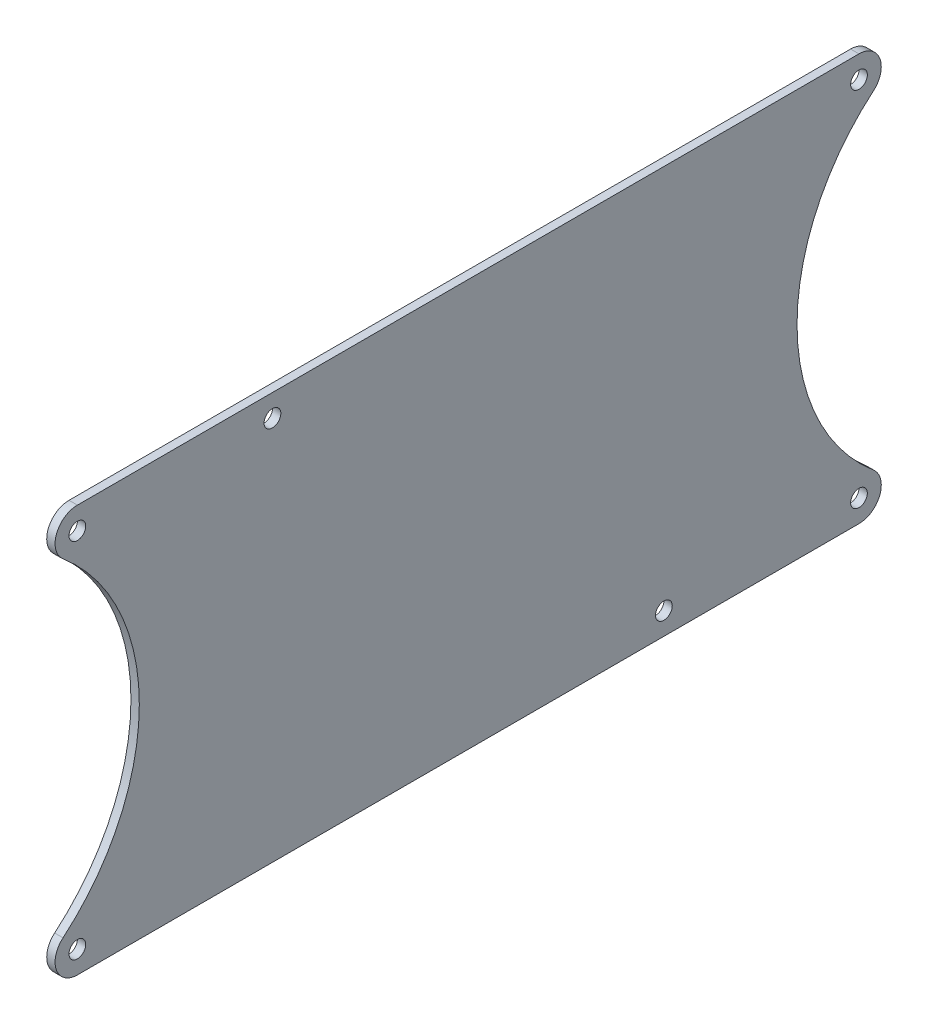
ISO-10303-21;
HEADER;
FILE_DESCRIPTION(('STEP AP214'),'2;1');
FILE_NAME('part.step','',(''),(''),'','','');
FILE_SCHEMA(('AUTOMOTIVE_DESIGN { 1 0 10303 214 1 1 1 1 }'));
ENDSEC;
DATA;
#1=APPLICATION_CONTEXT('core data for automotive mechanical design processes');
#2=APPLICATION_PROTOCOL_DEFINITION('international standard','automotive_design',2000,#1);
#3=PRODUCT_CONTEXT('',#1,'mechanical');
#4=PRODUCT('Part','Part','',(#3));
#5=PRODUCT_RELATED_PRODUCT_CATEGORY('part','',(#4));
#6=PRODUCT_DEFINITION_FORMATION('','',#4);
#7=PRODUCT_DEFINITION_CONTEXT('part definition',#1,'design');
#8=PRODUCT_DEFINITION('design','',#6,#7);
#9=PRODUCT_DEFINITION_SHAPE('','',#8);
#10=(LENGTH_UNIT() NAMED_UNIT(*) SI_UNIT(.MILLI.,.METRE.));
#11=(NAMED_UNIT(*) PLANE_ANGLE_UNIT() SI_UNIT($,.RADIAN.));
#12=(NAMED_UNIT(*) SI_UNIT($,.STERADIAN.) SOLID_ANGLE_UNIT());
#13=UNCERTAINTY_MEASURE_WITH_UNIT(LENGTH_MEASURE(1.E-05),#10,'distance_accuracy_value','');
#14=(GEOMETRIC_REPRESENTATION_CONTEXT(3) GLOBAL_UNCERTAINTY_ASSIGNED_CONTEXT((#13)) GLOBAL_UNIT_ASSIGNED_CONTEXT((#10,
#11,#12)) REPRESENTATION_CONTEXT('',''));
#15=CARTESIAN_POINT('',(0.,0.,0.));
#16=DIRECTION('',(0.,0.,1.));
#17=DIRECTION('',(1.,0.,0.));
#18=AXIS2_PLACEMENT_3D('',#15,#16,#17);
#19=CARTESIAN_POINT('',(1.5,3.71572232694461,-176.359202999625));
#20=DIRECTION('',(-1.,0.,0.));
#21=DIRECTION('',(0.,0.,1.));
#22=AXIS2_PLACEMENT_3D('',#19,#20,#21);
#23=CYLINDRICAL_SURFACE('',#22,38.5);
#24=CARTESIAN_POINT('',(0.,3.71572232694461,-176.359202999625));
#25=DIRECTION('',(1.,0.,0.));
#26=DIRECTION('',(0.,0.,-1.));
#27=AXIS2_PLACEMENT_3D('',#24,#25,#26);
#28=CIRCLE('',#27,38.5);
#29=CARTESIAN_POINT('',(0.,33.1568987975329,-151.550593042038));
#30=VERTEX_POINT('',#29);
#31=CARTESIAN_POINT('',(0.,-25.7254541436436,-151.550593042038));
#32=VERTEX_POINT('',#31);
#33=EDGE_CURVE('E120',#30,#32,#28,.T.);
#34=ORIENTED_EDGE('',*,*,#33,.F.);
#35=DIRECTION('',(-1.,0.,0.));
#36=VECTOR('',#35,1.);
#37=CARTESIAN_POINT('',(1.5,33.1568987975328,-151.550593042038));
#38=LINE('',#37,#36);
#39=CARTESIAN_POINT('',(1.5,33.1568987975329,-151.550593042038));
#40=VERTEX_POINT('',#39);
#41=EDGE_CURVE('E141',#30,#40,#38,.F.);
#42=ORIENTED_EDGE('',*,*,#41,.T.);
#43=CARTESIAN_POINT('',(1.5,3.71572232694461,-176.359202999625));
#44=DIRECTION('',(1.,0.,0.));
#45=DIRECTION('',(0.,0.,-1.));
#46=AXIS2_PLACEMENT_3D('',#43,#44,#45);
#47=CIRCLE('',#46,38.5);
#48=CARTESIAN_POINT('',(1.5,-25.7254541436436,-151.550593042038));
#49=VERTEX_POINT('',#48);
#50=EDGE_CURVE('E158',#40,#49,#47,.T.);
#51=ORIENTED_EDGE('',*,*,#50,.T.);
#52=DIRECTION('',(-1.,0.,0.));
#53=VECTOR('',#52,1.);
#54=CARTESIAN_POINT('',(1.5,-25.7254541436436,-151.550593042038));
#55=LINE('',#54,#53);
#56=EDGE_CURVE('E138',#49,#32,#55,.T.);
#57=ORIENTED_EDGE('',*,*,#56,.T.);
#58=EDGE_LOOP('',(#34,#42,#51,#57));
#59=FACE_BOUND('',#58,.T.);
#60=ADVANCED_FACE('F34',(#59),#23,.F.);
#61=CARTESIAN_POINT('',(1.5,40.2157223269446,0.));
#62=DIRECTION('',(0.,1.,0.));
#63=DIRECTION('',(0.,0.,1.));
#64=AXIS2_PLACEMENT_3D('',#61,#62,#63);
#65=PLANE('',#64);
#66=DIRECTION('',(0.,0.,-1.));
#67=VECTOR('',#66,1.);
#68=CARTESIAN_POINT('',(1.5,40.2157223269446,0.));
#69=LINE('',#68,#67);
#70=CARTESIAN_POINT('',(1.5,40.2157223269446,-8.74533087488335));
#71=VERTEX_POINT('',#70);
#72=CARTESIAN_POINT('',(1.5,40.2157223269446,-148.973075124367));
#73=VERTEX_POINT('',#72);
#74=EDGE_CURVE('E156',#71,#73,#69,.T.);
#75=ORIENTED_EDGE('',*,*,#74,.T.);
#76=DIRECTION('',(-1.,0.,0.));
#77=VECTOR('',#76,1.);
#78=CARTESIAN_POINT('',(1.5,40.2157223269446,-148.973075124367));
#79=LINE('',#78,#77);
#80=CARTESIAN_POINT('',(0.,40.2157223269446,-148.973075124367));
#81=VERTEX_POINT('',#80);
#82=EDGE_CURVE('E111',#73,#81,#79,.T.);
#83=ORIENTED_EDGE('',*,*,#82,.T.);
#84=DIRECTION('',(0.,0.,-1.));
#85=VECTOR('',#84,1.);
#86=CARTESIAN_POINT('',(0.,40.2157223269446,0.));
#87=LINE('',#86,#85);
#88=CARTESIAN_POINT('',(0.,40.2157223269446,-8.74533087488335));
#89=VERTEX_POINT('',#88);
#90=EDGE_CURVE('E103',#89,#81,#87,.T.);
#91=ORIENTED_EDGE('',*,*,#90,.F.);
#92=DIRECTION('',(-1.,0.,0.));
#93=VECTOR('',#92,1.);
#94=CARTESIAN_POINT('',(1.5,40.2157223269446,-8.74533087488335));
#95=LINE('',#94,#93);
#96=EDGE_CURVE('E117',#89,#71,#95,.F.);
#97=ORIENTED_EDGE('',*,*,#96,.T.);
#98=EDGE_LOOP('',(#75,#83,#91,#97));
#99=FACE_BOUND('',#98,.T.);
#100=ADVANCED_FACE('F116',(#99),#65,.T.);
#101=CARTESIAN_POINT('',(1.5,3.71572232694461,18.640797000375));
#102=DIRECTION('',(-1.,0.,0.));
#103=DIRECTION('',(0.,0.,1.));
#104=AXIS2_PLACEMENT_3D('',#101,#102,#103);
#105=CYLINDRICAL_SURFACE('',#104,38.5);
#106=CARTESIAN_POINT('',(0.,3.71572232694461,18.640797000375));
#107=DIRECTION('',(1.,0.,0.));
#108=DIRECTION('',(0.,0.,-1.));
#109=AXIS2_PLACEMENT_3D('',#106,#107,#108);
#110=CIRCLE('',#109,38.5);
#111=CARTESIAN_POINT('',(0.,-25.7254541436436,-6.16781295721198));
#112=VERTEX_POINT('',#111);
#113=CARTESIAN_POINT('',(0.,33.1568987975328,-6.16781295721198));
#114=VERTEX_POINT('',#113);
#115=EDGE_CURVE('E105',#112,#114,#110,.T.);
#116=ORIENTED_EDGE('',*,*,#115,.F.);
#117=DIRECTION('',(-1.,0.,0.));
#118=VECTOR('',#117,1.);
#119=CARTESIAN_POINT('',(1.5,-25.7254541436436,-6.16781295721198));
#120=LINE('',#119,#118);
#121=CARTESIAN_POINT('',(1.5,-25.7254541436436,-6.16781295721198));
#122=VERTEX_POINT('',#121);
#123=EDGE_CURVE('E11',#112,#122,#120,.F.);
#124=ORIENTED_EDGE('',*,*,#123,.T.);
#125=CARTESIAN_POINT('',(1.5,3.71572232694461,18.640797000375));
#126=DIRECTION('',(1.,0.,0.));
#127=DIRECTION('',(0.,0.,-1.));
#128=AXIS2_PLACEMENT_3D('',#125,#126,#127);
#129=CIRCLE('',#128,38.5);
#130=CARTESIAN_POINT('',(1.5,33.1568987975328,-6.16781295721198));
#131=VERTEX_POINT('',#130);
#132=EDGE_CURVE('E127',#122,#131,#129,.T.);
#133=ORIENTED_EDGE('',*,*,#132,.T.);
#134=DIRECTION('',(-1.,0.,0.));
#135=VECTOR('',#134,1.);
#136=CARTESIAN_POINT('',(1.5,33.1568987975329,-6.16781295721198));
#137=LINE('',#136,#135);
#138=EDGE_CURVE('E42',#131,#114,#137,.T.);
#139=ORIENTED_EDGE('',*,*,#138,.T.);
#140=EDGE_LOOP('',(#116,#124,#133,#139));
#141=FACE_BOUND('',#140,.T.);
#142=ADVANCED_FACE('F154',(#141),#105,.F.);
#143=CARTESIAN_POINT('',(1.5,-32.7842776730554,0.));
#144=DIRECTION('',(0.,1.,0.));
#145=DIRECTION('',(0.,0.,1.));
#146=AXIS2_PLACEMENT_3D('',#143,#144,#145);
#147=PLANE('',#146);
#148=DIRECTION('',(0.,0.,-1.));
#149=VECTOR('',#148,1.);
#150=CARTESIAN_POINT('',(0.,-32.7842776730554,0.));
#151=LINE('',#150,#149);
#152=CARTESIAN_POINT('',(0.,-32.7842776730554,-8.74533087488335));
#153=VERTEX_POINT('',#152);
#154=CARTESIAN_POINT('',(0.,-32.7842776730554,-148.973075124367));
#155=VERTEX_POINT('',#154);
#156=EDGE_CURVE('E130',#153,#155,#151,.T.);
#157=ORIENTED_EDGE('',*,*,#156,.T.);
#158=DIRECTION('',(1.,0.,0.));
#159=VECTOR('',#158,1.);
#160=CARTESIAN_POINT('',(1.5,-32.7842776730554,-148.973075124367));
#161=LINE('',#160,#159);
#162=CARTESIAN_POINT('',(1.5,-32.7842776730554,-148.973075124367));
#163=VERTEX_POINT('',#162);
#164=EDGE_CURVE('E49',#155,#163,#161,.T.);
#165=ORIENTED_EDGE('',*,*,#164,.T.);
#166=DIRECTION('',(0.,0.,-1.));
#167=VECTOR('',#166,1.);
#168=CARTESIAN_POINT('',(1.5,-32.7842776730554,0.));
#169=LINE('',#168,#167);
#170=CARTESIAN_POINT('',(1.5,-32.7842776730554,-8.74533087488335));
#171=VERTEX_POINT('',#170);
#172=EDGE_CURVE('E124',#171,#163,#169,.T.);
#173=ORIENTED_EDGE('',*,*,#172,.F.);
#174=DIRECTION('',(1.,0.,0.));
#175=VECTOR('',#174,1.);
#176=CARTESIAN_POINT('',(0.,-32.7842776730554,-8.74533087488335));
#177=LINE('',#176,#175);
#178=EDGE_CURVE('E149',#171,#153,#177,.F.);
#179=ORIENTED_EDGE('',*,*,#178,.T.);
#180=EDGE_LOOP('',(#157,#165,#173,#179));
#181=FACE_BOUND('',#180,.T.);
#182=ADVANCED_FACE('F212',(#181),#147,.F.);
#183=CARTESIAN_POINT('',(1.5,0.,0.));
#184=DIRECTION('',(1.,0.,0.));
#185=DIRECTION('',(0.,0.,-1.));
#186=AXIS2_PLACEMENT_3D('',#183,#184,#185);
#187=PLANE('',#186);
#188=CARTESIAN_POINT('',(1.5,36.2157223269446,-8.74533087488335));
#189=DIRECTION('',(1.,0.,0.));
#190=DIRECTION('',(0.,0.,-1.));
#191=AXIS2_PLACEMENT_3D('',#188,#189,#190);
#192=CIRCLE('',#191,1.49999999999999);
#193=CARTESIAN_POINT('',(1.5,36.2157223269446,-10.2453308748833));
#194=VERTEX_POINT('',#193);
#195=EDGE_CURVE('E202',#194,#194,#192,.T.);
#196=ORIENTED_EDGE('',*,*,#195,.F.);
#197=EDGE_LOOP('',(#196));
#198=FACE_BOUND('',#197,.T.);
#199=CARTESIAN_POINT('',(1.5,36.2157223269446,-148.973075124367));
#200=DIRECTION('',(1.,0.,0.));
#201=DIRECTION('',(0.,0.,-1.));
#202=AXIS2_PLACEMENT_3D('',#199,#200,#201);
#203=CIRCLE('',#202,1.49999999999999);
#204=CARTESIAN_POINT('',(1.5,36.2157223269446,-150.473075124367));
#205=VERTEX_POINT('',#204);
#206=EDGE_CURVE('E196',#205,#205,#203,.T.);
#207=ORIENTED_EDGE('',*,*,#206,.F.);
#208=EDGE_LOOP('',(#207));
#209=FACE_BOUND('',#208,.T.);
#210=CARTESIAN_POINT('',(1.5,-28.7842776730554,-148.973075124367));
#211=DIRECTION('',(1.,0.,0.));
#212=DIRECTION('',(0.,0.,-1.));
#213=AXIS2_PLACEMENT_3D('',#210,#211,#212);
#214=CIRCLE('',#213,1.49999999999999);
#215=CARTESIAN_POINT('',(1.5,-28.7842776730554,-150.473075124367));
#216=VERTEX_POINT('',#215);
#217=EDGE_CURVE('E190',#216,#216,#214,.T.);
#218=ORIENTED_EDGE('',*,*,#217,.F.);
#219=EDGE_LOOP('',(#218));
#220=FACE_BOUND('',#219,.T.);
#221=CARTESIAN_POINT('',(1.5,-28.7842776730554,-8.74533087488335));
#222=DIRECTION('',(1.,0.,0.));
#223=DIRECTION('',(0.,0.,-1.));
#224=AXIS2_PLACEMENT_3D('',#221,#222,#223);
#225=CIRCLE('',#224,1.49999999999999);
#226=CARTESIAN_POINT('',(1.5,-28.7842776730554,-10.2453308748833));
#227=VERTEX_POINT('',#226);
#228=EDGE_CURVE('E184',#227,#227,#225,.T.);
#229=ORIENTED_EDGE('',*,*,#228,.F.);
#230=EDGE_LOOP('',(#229));
#231=FACE_BOUND('',#230,.T.);
#232=CARTESIAN_POINT('',(1.5,36.2157223269446,-43.7453308748834));
#233=DIRECTION('',(1.,0.,0.));
#234=DIRECTION('',(0.,0.,-1.));
#235=AXIS2_PLACEMENT_3D('',#232,#233,#234);
#236=CIRCLE('',#235,1.49999999999999);
#237=CARTESIAN_POINT('',(1.5,36.2157223269446,-45.2453308748833));
#238=VERTEX_POINT('',#237);
#239=EDGE_CURVE('E178',#238,#238,#236,.T.);
#240=ORIENTED_EDGE('',*,*,#239,.F.);
#241=EDGE_LOOP('',(#240));
#242=FACE_BOUND('',#241,.T.);
#243=CARTESIAN_POINT('',(1.5,-28.7842776730554,-113.973075124367));
#244=DIRECTION('',(1.,0.,0.));
#245=DIRECTION('',(0.,0.,-1.));
#246=AXIS2_PLACEMENT_3D('',#243,#244,#245);
#247=CIRCLE('',#246,1.49999999999999);
#248=CARTESIAN_POINT('',(1.5,-28.7842776730554,-115.473075124367));
#249=VERTEX_POINT('',#248);
#250=EDGE_CURVE('E172',#249,#249,#247,.T.);
#251=ORIENTED_EDGE('',*,*,#250,.F.);
#252=EDGE_LOOP('',(#251));
#253=FACE_BOUND('',#252,.T.);
#254=ORIENTED_EDGE('',*,*,#50,.F.);
#255=CARTESIAN_POINT('',(1.5,36.2157223269446,-148.973075124367));
#256=DIRECTION('',(1.,0.,0.));
#257=DIRECTION('',(0.,0.,-1.));
#258=AXIS2_PLACEMENT_3D('',#255,#256,#257);
#259=CIRCLE('',#258,4.);
#260=EDGE_CURVE('E147',#40,#73,#259,.T.);
#261=ORIENTED_EDGE('',*,*,#260,.T.);
#262=ORIENTED_EDGE('',*,*,#74,.F.);
#263=CARTESIAN_POINT('',(1.5,36.2157223269446,-8.74533087488335));
#264=DIRECTION('',(1.,0.,0.));
#265=DIRECTION('',(0.,0.,-1.));
#266=AXIS2_PLACEMENT_3D('',#263,#264,#265);
#267=CIRCLE('',#266,4.);
#268=EDGE_CURVE('E123',#71,#131,#267,.T.);
#269=ORIENTED_EDGE('',*,*,#268,.T.);
#270=ORIENTED_EDGE('',*,*,#132,.F.);
#271=CARTESIAN_POINT('',(1.5,-28.7842776730554,-8.74533087488335));
#272=DIRECTION('',(1.,0.,0.));
#273=DIRECTION('',(0.,0.,-1.));
#274=AXIS2_PLACEMENT_3D('',#271,#272,#273);
#275=CIRCLE('',#274,4.);
#276=EDGE_CURVE('E56',#122,#171,#275,.T.);
#277=ORIENTED_EDGE('',*,*,#276,.T.);
#278=ORIENTED_EDGE('',*,*,#172,.T.);
#279=CARTESIAN_POINT('',(1.5,-28.7842776730554,-148.973075124367));
#280=DIRECTION('',(1.,0.,0.));
#281=DIRECTION('',(0.,0.,-1.));
#282=AXIS2_PLACEMENT_3D('',#279,#280,#281);
#283=CIRCLE('',#282,4.);
#284=EDGE_CURVE('E145',#163,#49,#283,.T.);
#285=ORIENTED_EDGE('',*,*,#284,.T.);
#286=EDGE_LOOP('',(#254,#261,#262,#269,#270,#277,#278,#285));
#287=FACE_BOUND('',#286,.T.);
#288=ADVANCED_FACE('F209',(#198,#209,#220,#231,#242,#253,#287),#187,.T.);
#289=CARTESIAN_POINT('',(0.,0.,0.));
#290=DIRECTION('',(1.,0.,0.));
#291=DIRECTION('',(0.,0.,-1.));
#292=AXIS2_PLACEMENT_3D('',#289,#290,#291);
#293=PLANE('',#292);
#294=CARTESIAN_POINT('',(0.,36.2157223269446,-8.74533087488335));
#295=DIRECTION('',(1.,0.,0.));
#296=DIRECTION('',(0.,0.,-1.));
#297=AXIS2_PLACEMENT_3D('',#294,#295,#296);
#298=CIRCLE('',#297,1.49999999999999);
#299=CARTESIAN_POINT('',(0.,36.2157223269446,-10.2453308748833));
#300=VERTEX_POINT('',#299);
#301=EDGE_CURVE('E199',#300,#300,#298,.T.);
#302=ORIENTED_EDGE('',*,*,#301,.T.);
#303=EDGE_LOOP('',(#302));
#304=FACE_BOUND('',#303,.T.);
#305=CARTESIAN_POINT('',(0.,36.2157223269446,-148.973075124367));
#306=DIRECTION('',(1.,0.,0.));
#307=DIRECTION('',(0.,0.,-1.));
#308=AXIS2_PLACEMENT_3D('',#305,#306,#307);
#309=CIRCLE('',#308,1.49999999999999);
#310=CARTESIAN_POINT('',(0.,36.2157223269446,-150.473075124367));
#311=VERTEX_POINT('',#310);
#312=EDGE_CURVE('E193',#311,#311,#309,.T.);
#313=ORIENTED_EDGE('',*,*,#312,.T.);
#314=EDGE_LOOP('',(#313));
#315=FACE_BOUND('',#314,.T.);
#316=CARTESIAN_POINT('',(0.,-28.7842776730554,-148.973075124367));
#317=DIRECTION('',(1.,0.,0.));
#318=DIRECTION('',(0.,0.,-1.));
#319=AXIS2_PLACEMENT_3D('',#316,#317,#318);
#320=CIRCLE('',#319,1.49999999999999);
#321=CARTESIAN_POINT('',(0.,-28.7842776730554,-150.473075124367));
#322=VERTEX_POINT('',#321);
#323=EDGE_CURVE('E187',#322,#322,#320,.T.);
#324=ORIENTED_EDGE('',*,*,#323,.T.);
#325=EDGE_LOOP('',(#324));
#326=FACE_BOUND('',#325,.T.);
#327=CARTESIAN_POINT('',(0.,-28.7842776730554,-8.74533087488335));
#328=DIRECTION('',(1.,0.,0.));
#329=DIRECTION('',(0.,0.,-1.));
#330=AXIS2_PLACEMENT_3D('',#327,#328,#329);
#331=CIRCLE('',#330,1.49999999999999);
#332=CARTESIAN_POINT('',(0.,-28.7842776730554,-10.2453308748833));
#333=VERTEX_POINT('',#332);
#334=EDGE_CURVE('E181',#333,#333,#331,.T.);
#335=ORIENTED_EDGE('',*,*,#334,.T.);
#336=EDGE_LOOP('',(#335));
#337=FACE_BOUND('',#336,.T.);
#338=CARTESIAN_POINT('',(0.,36.2157223269446,-43.7453308748834));
#339=DIRECTION('',(1.,0.,0.));
#340=DIRECTION('',(0.,0.,-1.));
#341=AXIS2_PLACEMENT_3D('',#338,#339,#340);
#342=CIRCLE('',#341,1.49999999999999);
#343=CARTESIAN_POINT('',(0.,36.2157223269446,-45.2453308748833));
#344=VERTEX_POINT('',#343);
#345=EDGE_CURVE('E175',#344,#344,#342,.T.);
#346=ORIENTED_EDGE('',*,*,#345,.T.);
#347=EDGE_LOOP('',(#346));
#348=FACE_BOUND('',#347,.T.);
#349=CARTESIAN_POINT('',(0.,-28.7842776730554,-113.973075124367));
#350=DIRECTION('',(1.,0.,0.));
#351=DIRECTION('',(0.,0.,-1.));
#352=AXIS2_PLACEMENT_3D('',#349,#350,#351);
#353=CIRCLE('',#352,1.49999999999999);
#354=CARTESIAN_POINT('',(0.,-28.7842776730554,-115.473075124367));
#355=VERTEX_POINT('',#354);
#356=EDGE_CURVE('E163',#355,#355,#353,.T.);
#357=ORIENTED_EDGE('',*,*,#356,.T.);
#358=EDGE_LOOP('',(#357));
#359=FACE_BOUND('',#358,.T.);
#360=ORIENTED_EDGE('',*,*,#90,.T.);
#361=CARTESIAN_POINT('',(0.,36.2157223269446,-148.973075124367));
#362=DIRECTION('',(1.,0.,0.));
#363=DIRECTION('',(0.,0.,-1.));
#364=AXIS2_PLACEMENT_3D('',#361,#362,#363);
#365=CIRCLE('',#364,4.);
#366=EDGE_CURVE('E136',#81,#30,#365,.F.);
#367=ORIENTED_EDGE('',*,*,#366,.T.);
#368=ORIENTED_EDGE('',*,*,#33,.T.);
#369=CARTESIAN_POINT('',(0.,-28.7842776730554,-148.973075124367));
#370=DIRECTION('',(1.,0.,0.));
#371=DIRECTION('',(0.,0.,-1.));
#372=AXIS2_PLACEMENT_3D('',#369,#370,#371);
#373=CIRCLE('',#372,4.);
#374=EDGE_CURVE('E134',#32,#155,#373,.F.);
#375=ORIENTED_EDGE('',*,*,#374,.T.);
#376=ORIENTED_EDGE('',*,*,#156,.F.);
#377=CARTESIAN_POINT('',(0.,-28.7842776730554,-8.74533087488335));
#378=DIRECTION('',(1.,0.,0.));
#379=DIRECTION('',(0.,0.,-1.));
#380=AXIS2_PLACEMENT_3D('',#377,#378,#379);
#381=CIRCLE('',#380,4.);
#382=EDGE_CURVE('E110',#153,#112,#381,.F.);
#383=ORIENTED_EDGE('',*,*,#382,.T.);
#384=ORIENTED_EDGE('',*,*,#115,.T.);
#385=CARTESIAN_POINT('',(0.,36.2157223269446,-8.74533087488335));
#386=DIRECTION('',(1.,0.,0.));
#387=DIRECTION('',(0.,0.,-1.));
#388=AXIS2_PLACEMENT_3D('',#385,#386,#387);
#389=CIRCLE('',#388,4.);
#390=EDGE_CURVE('E100',#114,#89,#389,.F.);
#391=ORIENTED_EDGE('',*,*,#390,.T.);
#392=EDGE_LOOP('',(#360,#367,#368,#375,#376,#383,#384,#391));
#393=FACE_BOUND('',#392,.T.);
#394=ADVANCED_FACE('F102',(#304,#315,#326,#337,#348,#359,#393),#293,.F.);
#395=CARTESIAN_POINT('',(1.5,36.2157223269446,-148.973075124367));
#396=DIRECTION('',(-1.,0.,0.));
#397=DIRECTION('',(0.,0.,1.));
#398=AXIS2_PLACEMENT_3D('',#395,#396,#397);
#399=CYLINDRICAL_SURFACE('',#398,4.);
#400=ORIENTED_EDGE('',*,*,#260,.F.);
#401=ORIENTED_EDGE('',*,*,#41,.F.);
#402=ORIENTED_EDGE('',*,*,#366,.F.);
#403=ORIENTED_EDGE('',*,*,#82,.F.);
#404=EDGE_LOOP('',(#400,#401,#402,#403));
#405=FACE_BOUND('',#404,.T.);
#406=ADVANCED_FACE('F227',(#405),#399,.T.);
#407=CARTESIAN_POINT('',(1.5,-28.7842776730554,-148.973075124367));
#408=DIRECTION('',(-1.,0.,0.));
#409=DIRECTION('',(0.,0.,1.));
#410=AXIS2_PLACEMENT_3D('',#407,#408,#409);
#411=CYLINDRICAL_SURFACE('',#410,4.);
#412=ORIENTED_EDGE('',*,*,#284,.F.);
#413=ORIENTED_EDGE('',*,*,#164,.F.);
#414=ORIENTED_EDGE('',*,*,#374,.F.);
#415=ORIENTED_EDGE('',*,*,#56,.F.);
#416=EDGE_LOOP('',(#412,#413,#414,#415));
#417=FACE_BOUND('',#416,.T.);
#418=ADVANCED_FACE('F230',(#417),#411,.T.);
#419=CARTESIAN_POINT('',(1.5,-28.7842776730554,-8.74533087488335));
#420=DIRECTION('',(-1.,0.,0.));
#421=DIRECTION('',(0.,0.,1.));
#422=AXIS2_PLACEMENT_3D('',#419,#420,#421);
#423=CYLINDRICAL_SURFACE('',#422,4.);
#424=ORIENTED_EDGE('',*,*,#276,.F.);
#425=ORIENTED_EDGE('',*,*,#123,.F.);
#426=ORIENTED_EDGE('',*,*,#382,.F.);
#427=ORIENTED_EDGE('',*,*,#178,.F.);
#428=EDGE_LOOP('',(#424,#425,#426,#427));
#429=FACE_BOUND('',#428,.T.);
#430=ADVANCED_FACE('F233',(#429),#423,.T.);
#431=CARTESIAN_POINT('',(1.5,36.2157223269446,-8.74533087488335));
#432=DIRECTION('',(-1.,0.,0.));
#433=DIRECTION('',(0.,0.,1.));
#434=AXIS2_PLACEMENT_3D('',#431,#432,#433);
#435=CYLINDRICAL_SURFACE('',#434,4.);
#436=ORIENTED_EDGE('',*,*,#268,.F.);
#437=ORIENTED_EDGE('',*,*,#96,.F.);
#438=ORIENTED_EDGE('',*,*,#390,.F.);
#439=ORIENTED_EDGE('',*,*,#138,.F.);
#440=EDGE_LOOP('',(#436,#437,#438,#439));
#441=FACE_BOUND('',#440,.T.);
#442=ADVANCED_FACE('F36',(#441),#435,.T.);
#443=CARTESIAN_POINT('',(1.5,-28.7842776730554,-113.973075124367));
#444=DIRECTION('',(1.,0.,0.));
#445=DIRECTION('',(0.,0.,-1.));
#446=AXIS2_PLACEMENT_3D('',#443,#444,#445);
#447=CYLINDRICAL_SURFACE('',#446,1.49999999999999);
#448=ORIENTED_EDGE('',*,*,#250,.T.);
#449=EDGE_LOOP('',(#448));
#450=FACE_BOUND('',#449,.T.);
#451=ORIENTED_EDGE('',*,*,#356,.F.);
#452=EDGE_LOOP('',(#451));
#453=FACE_BOUND('',#452,.T.);
#454=ADVANCED_FACE('F255',(#450,#453),#447,.F.);
#455=CARTESIAN_POINT('',(1.5,36.2157223269446,-43.7453308748834));
#456=DIRECTION('',(1.,0.,0.));
#457=DIRECTION('',(0.,0.,-1.));
#458=AXIS2_PLACEMENT_3D('',#455,#456,#457);
#459=CYLINDRICAL_SURFACE('',#458,1.49999999999999);
#460=ORIENTED_EDGE('',*,*,#239,.T.);
#461=EDGE_LOOP('',(#460));
#462=FACE_BOUND('',#461,.T.);
#463=ORIENTED_EDGE('',*,*,#345,.F.);
#464=EDGE_LOOP('',(#463));
#465=FACE_BOUND('',#464,.T.);
#466=ADVANCED_FACE('F259',(#462,#465),#459,.F.);
#467=CARTESIAN_POINT('',(1.5,-28.7842776730554,-8.74533087488335));
#468=DIRECTION('',(1.,0.,0.));
#469=DIRECTION('',(0.,0.,-1.));
#470=AXIS2_PLACEMENT_3D('',#467,#468,#469);
#471=CYLINDRICAL_SURFACE('',#470,1.49999999999999);
#472=ORIENTED_EDGE('',*,*,#228,.T.);
#473=EDGE_LOOP('',(#472));
#474=FACE_BOUND('',#473,.T.);
#475=ORIENTED_EDGE('',*,*,#334,.F.);
#476=EDGE_LOOP('',(#475));
#477=FACE_BOUND('',#476,.T.);
#478=ADVANCED_FACE('F265',(#474,#477),#471,.F.);
#479=CARTESIAN_POINT('',(1.5,-28.7842776730554,-148.973075124367));
#480=DIRECTION('',(1.,0.,0.));
#481=DIRECTION('',(0.,0.,-1.));
#482=AXIS2_PLACEMENT_3D('',#479,#480,#481);
#483=CYLINDRICAL_SURFACE('',#482,1.49999999999999);
#484=ORIENTED_EDGE('',*,*,#217,.T.);
#485=EDGE_LOOP('',(#484));
#486=FACE_BOUND('',#485,.T.);
#487=ORIENTED_EDGE('',*,*,#323,.F.);
#488=EDGE_LOOP('',(#487));
#489=FACE_BOUND('',#488,.T.);
#490=ADVANCED_FACE('F288',(#486,#489),#483,.F.);
#491=CARTESIAN_POINT('',(1.5,36.2157223269446,-148.973075124367));
#492=DIRECTION('',(1.,0.,0.));
#493=DIRECTION('',(0.,0.,-1.));
#494=AXIS2_PLACEMENT_3D('',#491,#492,#493);
#495=CYLINDRICAL_SURFACE('',#494,1.49999999999999);
#496=ORIENTED_EDGE('',*,*,#206,.T.);
#497=EDGE_LOOP('',(#496));
#498=FACE_BOUND('',#497,.T.);
#499=ORIENTED_EDGE('',*,*,#312,.F.);
#500=EDGE_LOOP('',(#499));
#501=FACE_BOUND('',#500,.T.);
#502=ADVANCED_FACE('F293',(#498,#501),#495,.F.);
#503=CARTESIAN_POINT('',(1.5,36.2157223269446,-8.74533087488335));
#504=DIRECTION('',(1.,0.,0.));
#505=DIRECTION('',(0.,0.,-1.));
#506=AXIS2_PLACEMENT_3D('',#503,#504,#505);
#507=CYLINDRICAL_SURFACE('',#506,1.49999999999999);
#508=ORIENTED_EDGE('',*,*,#195,.T.);
#509=EDGE_LOOP('',(#508));
#510=FACE_BOUND('',#509,.T.);
#511=ORIENTED_EDGE('',*,*,#301,.F.);
#512=EDGE_LOOP('',(#511));
#513=FACE_BOUND('',#512,.T.);
#514=ADVANCED_FACE('F206',(#510,#513),#507,.F.);
#515=CLOSED_SHELL('',(#60,#100,#142,#182,#288,#394,#406,#418,#430,#442,#454,#466,#478,#490,#502,#514));
#516=MANIFOLD_SOLID_BREP('B2',#515);
#517=ADVANCED_BREP_SHAPE_REPRESENTATION('',(#18,#516),#14);
#518=SHAPE_DEFINITION_REPRESENTATION(#9,#517);
ENDSEC;
END-ISO-10303-21;
